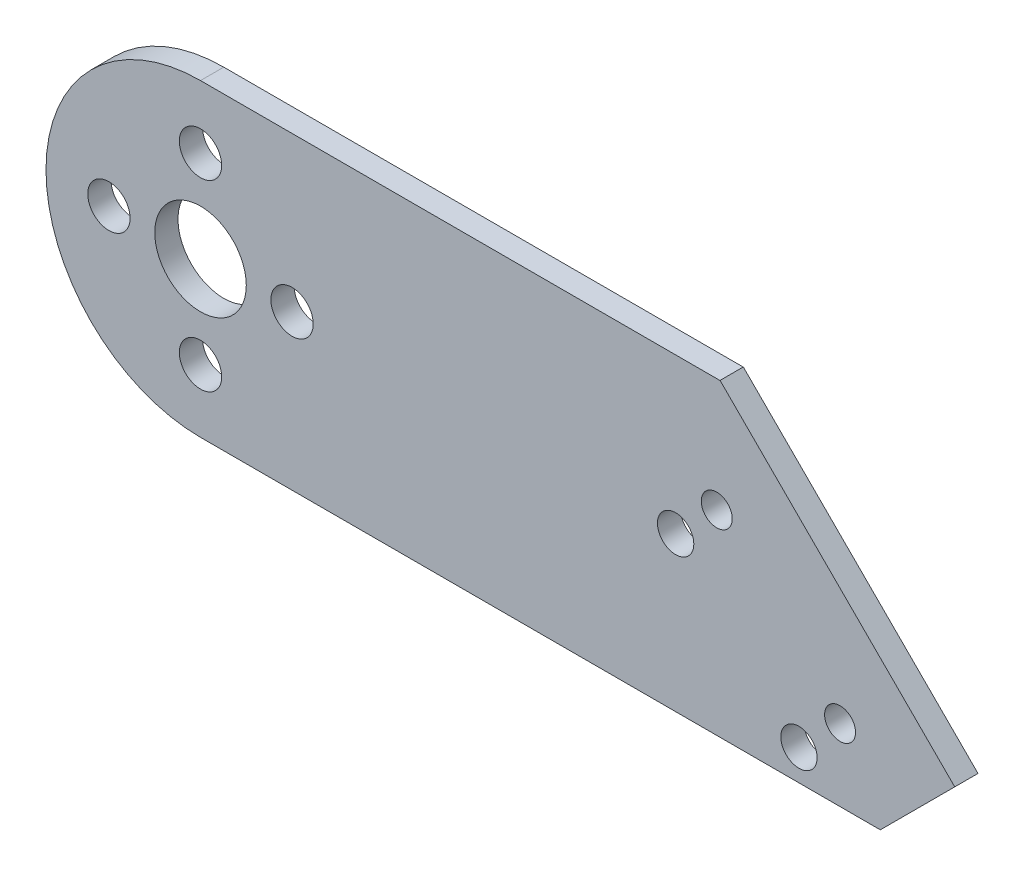
ISO-10303-21;
HEADER;
FILE_DESCRIPTION(('STEP AP214'),'2;1');
FILE_NAME('part.step','',(''),(''),'','','');
FILE_SCHEMA(('AUTOMOTIVE_DESIGN { 1 0 10303 214 1 1 1 1 }'));
ENDSEC;
DATA;
#1=APPLICATION_CONTEXT('core data for automotive mechanical design processes');
#2=APPLICATION_PROTOCOL_DEFINITION('international standard','automotive_design',2000,#1);
#3=PRODUCT_CONTEXT('',#1,'mechanical');
#4=PRODUCT('Part','Part','',(#3));
#5=PRODUCT_RELATED_PRODUCT_CATEGORY('part','',(#4));
#6=PRODUCT_DEFINITION_FORMATION('','',#4);
#7=PRODUCT_DEFINITION_CONTEXT('part definition',#1,'design');
#8=PRODUCT_DEFINITION('design','',#6,#7);
#9=PRODUCT_DEFINITION_SHAPE('','',#8);
#10=(LENGTH_UNIT() NAMED_UNIT(*) SI_UNIT(.MILLI.,.METRE.));
#11=(NAMED_UNIT(*) PLANE_ANGLE_UNIT() SI_UNIT($,.RADIAN.));
#12=(NAMED_UNIT(*) SI_UNIT($,.STERADIAN.) SOLID_ANGLE_UNIT());
#13=UNCERTAINTY_MEASURE_WITH_UNIT(LENGTH_MEASURE(1.E-05),#10,'distance_accuracy_value','');
#14=(GEOMETRIC_REPRESENTATION_CONTEXT(3) GLOBAL_UNCERTAINTY_ASSIGNED_CONTEXT((#13)) GLOBAL_UNIT_ASSIGNED_CONTEXT((#10,
#11,#12)) REPRESENTATION_CONTEXT('',''));
#15=CARTESIAN_POINT('',(0.,0.,0.));
#16=DIRECTION('',(0.,0.,1.));
#17=DIRECTION('',(1.,0.,0.));
#18=AXIS2_PLACEMENT_3D('',#15,#16,#17);
#19=CARTESIAN_POINT('',(0.,0.,2.032));
#20=DIRECTION('',(0.,0.,1.));
#21=DIRECTION('',(1.,0.,0.));
#22=AXIS2_PLACEMENT_3D('',#19,#20,#21);
#23=PLANE('',#22);
#24=CARTESIAN_POINT('',(41.5149259172451,-0.0303229251774669,2.032));
#25=DIRECTION('',(0.,0.,1.));
#26=DIRECTION('',(1.,0.,0.));
#27=AXIS2_PLACEMENT_3D('',#24,#25,#26);
#28=CIRCLE('',#27,1.5875);
#29=CARTESIAN_POINT('',(43.1024259172451,-0.0303229251774669,2.032));
#30=VERTEX_POINT('',#29);
#31=EDGE_CURVE('E221',#30,#30,#28,.T.);
#32=ORIENTED_EDGE('',*,*,#31,.F.);
#33=EDGE_LOOP('',(#32));
#34=FACE_BOUND('',#33,.T.);
#35=CARTESIAN_POINT('',(-7.99999999999998,0.,2.032));
#36=DIRECTION('',(0.,0.,1.));
#37=DIRECTION('',(1.,0.,0.));
#38=AXIS2_PLACEMENT_3D('',#35,#36,#37);
#39=CIRCLE('',#38,1.85);
#40=CARTESIAN_POINT('',(-6.14999999999998,0.,2.032));
#41=VERTEX_POINT('',#40);
#42=EDGE_CURVE('E233',#41,#41,#39,.T.);
#43=ORIENTED_EDGE('',*,*,#42,.F.);
#44=EDGE_LOOP('',(#43));
#45=FACE_BOUND('',#44,.T.);
#46=CARTESIAN_POINT('',(0.,0.,2.032));
#47=DIRECTION('',(0.,0.,1.));
#48=DIRECTION('',(1.,0.,0.));
#49=AXIS2_PLACEMENT_3D('',#46,#47,#48);
#50=CIRCLE('',#49,4.);
#51=CARTESIAN_POINT('',(4.00000000000003,0.,2.032));
#52=VERTEX_POINT('',#51);
#53=EDGE_CURVE('E245',#52,#52,#50,.T.);
#54=ORIENTED_EDGE('',*,*,#53,.F.);
#55=EDGE_LOOP('',(#54));
#56=FACE_BOUND('',#55,.T.);
#57=CARTESIAN_POINT('',(55.8833357109557,-7.2145278220328,2.032));
#58=DIRECTION('',(0.,0.,1.));
#59=DIRECTION('',(1.,0.,0.));
#60=AXIS2_PLACEMENT_3D('',#57,#58,#59);
#61=CIRCLE('',#60,1.35254999999999);
#62=CARTESIAN_POINT('',(57.2358857109557,-7.2145278220328,2.032));
#63=VERTEX_POINT('',#62);
#64=EDGE_CURVE('E257',#63,#63,#61,.T.);
#65=ORIENTED_EDGE('',*,*,#64,.F.);
#66=EDGE_LOOP('',(#65));
#67=FACE_BOUND('',#66,.T.);
#68=DIRECTION('',(-0.707106781186548,0.707106781186547,0.));
#69=VECTOR('',#68,1.);
#70=CARTESIAN_POINT('',(65.9023316935879,-6.99603182664613,2.032));
#71=LINE('',#70,#69);
#72=CARTESIAN_POINT('',(65.9023316935879,-6.99603182664613,2.032));
#73=VERTEX_POINT('',#72);
#74=CARTESIAN_POINT('',(45.396235039178,13.5100648277637,2.032));
#75=VERTEX_POINT('',#74);
#76=EDGE_CURVE('E141',#73,#75,#71,.T.);
#77=ORIENTED_EDGE('',*,*,#76,.T.);
#78=DIRECTION('',(-0.707106781187035,-0.70710678118606,0.));
#79=VECTOR('',#78,1.);
#80=CARTESIAN_POINT('',(45.396235039178,13.5100648277637,2.032));
#81=LINE('',#80,#79);
#82=CARTESIAN_POINT('',(45.3861702114143,13.5,2.032));
#83=VERTEX_POINT('',#82);
#84=EDGE_CURVE('E99',#75,#83,#81,.T.);
#85=ORIENTED_EDGE('',*,*,#84,.T.);
#86=DIRECTION('',(-1.,0.,0.));
#87=VECTOR('',#86,1.);
#88=CARTESIAN_POINT('',(45.3861702114143,13.5,2.032));
#89=LINE('',#88,#87);
#90=CARTESIAN_POINT('',(0.,13.5,2.032));
#91=VERTEX_POINT('',#90);
#92=EDGE_CURVE('E112',#83,#91,#89,.T.);
#93=ORIENTED_EDGE('',*,*,#92,.T.);
#94=CARTESIAN_POINT('',(0.,0.,2.032));
#95=DIRECTION('',(0.,0.,1.));
#96=DIRECTION('',(1.,0.,0.));
#97=AXIS2_PLACEMENT_3D('',#94,#95,#96);
#98=CIRCLE('',#97,13.5);
#99=CARTESIAN_POINT('',(0.,-13.5,2.032));
#100=VERTEX_POINT('',#99);
#101=EDGE_CURVE('E106',#91,#100,#98,.T.);
#102=ORIENTED_EDGE('',*,*,#101,.T.);
#103=DIRECTION('',(1.,0.,0.));
#104=VECTOR('',#103,1.);
#105=CARTESIAN_POINT('',(0.,-13.5,2.032));
#106=LINE('',#105,#104);
#107=CARTESIAN_POINT('',(59.398363520234,-13.5,2.032));
#108=VERTEX_POINT('',#107);
#109=EDGE_CURVE('E110',#100,#108,#106,.T.);
#110=ORIENTED_EDGE('',*,*,#109,.T.);
#111=DIRECTION('',(0.707106781186547,0.707106781186547,0.));
#112=VECTOR('',#111,1.);
#113=CARTESIAN_POINT('',(59.398363520234,-13.5,2.032));
#114=LINE('',#113,#112);
#115=EDGE_CURVE('E62',#108,#73,#114,.T.);
#116=ORIENTED_EDGE('',*,*,#115,.T.);
#117=EDGE_LOOP('',(#77,#85,#93,#102,#110,#116));
#118=FACE_BOUND('',#117,.T.);
#119=CARTESIAN_POINT('',(8.00000000000003,0.,2.032));
#120=DIRECTION('',(0.,0.,1.));
#121=DIRECTION('',(1.,0.,0.));
#122=AXIS2_PLACEMENT_3D('',#119,#120,#121);
#123=CIRCLE('',#122,1.85);
#124=CARTESIAN_POINT('',(9.85000000000003,0.,2.032));
#125=VERTEX_POINT('',#124);
#126=EDGE_CURVE('E134',#125,#125,#123,.T.);
#127=ORIENTED_EDGE('',*,*,#126,.F.);
#128=EDGE_LOOP('',(#127));
#129=FACE_BOUND('',#128,.T.);
#130=CARTESIAN_POINT('',(45.1070283656727,3.56177952325019,2.032));
#131=DIRECTION('',(0.,0.,1.));
#132=DIRECTION('',(1.,0.,0.));
#133=AXIS2_PLACEMENT_3D('',#130,#131,#132);
#134=CIRCLE('',#133,1.35254999999999);
#135=CARTESIAN_POINT('',(46.4595783656727,3.56177952325019,2.032));
#136=VERTEX_POINT('',#135);
#137=EDGE_CURVE('E251',#136,#136,#134,.T.);
#138=ORIENTED_EDGE('',*,*,#137,.F.);
#139=EDGE_LOOP('',(#138));
#140=FACE_BOUND('',#139,.T.);
#141=CARTESIAN_POINT('',(0.,-8.00000000000001,2.032));
#142=DIRECTION('',(0.,0.,1.));
#143=DIRECTION('',(1.,0.,0.));
#144=AXIS2_PLACEMENT_3D('',#141,#142,#143);
#145=CIRCLE('',#144,1.85);
#146=CARTESIAN_POINT('',(1.85000000000003,-8.00000000000001,2.032));
#147=VERTEX_POINT('',#146);
#148=EDGE_CURVE('E239',#147,#147,#145,.T.);
#149=ORIENTED_EDGE('',*,*,#148,.F.);
#150=EDGE_LOOP('',(#149));
#151=FACE_BOUND('',#150,.T.);
#152=CARTESIAN_POINT('',(0.,7.99999999999999,2.032));
#153=DIRECTION('',(0.,0.,1.));
#154=DIRECTION('',(1.,0.,0.));
#155=AXIS2_PLACEMENT_3D('',#152,#153,#154);
#156=CIRCLE('',#155,1.85);
#157=CARTESIAN_POINT('',(1.85000000000003,7.99999999999999,2.032));
#158=VERTEX_POINT('',#157);
#159=EDGE_CURVE('E227',#158,#158,#156,.T.);
#160=ORIENTED_EDGE('',*,*,#159,.F.);
#161=EDGE_LOOP('',(#160));
#162=FACE_BOUND('',#161,.T.);
#163=CARTESIAN_POINT('',(52.2912332625281,-10.8066302704605,2.032));
#164=DIRECTION('',(0.,0.,1.));
#165=DIRECTION('',(1.,0.,0.));
#166=AXIS2_PLACEMENT_3D('',#163,#164,#165);
#167=CIRCLE('',#166,1.5875);
#168=CARTESIAN_POINT('',(53.8787332625281,-10.8066302704605,2.032));
#169=VERTEX_POINT('',#168);
#170=EDGE_CURVE('E212',#169,#169,#167,.T.);
#171=ORIENTED_EDGE('',*,*,#170,.F.);
#172=EDGE_LOOP('',(#171));
#173=FACE_BOUND('',#172,.T.);
#174=ADVANCED_FACE('F45',(#34,#45,#56,#67,#118,#129,#140,#151,#162,#173),#23,.T.);
#175=CARTESIAN_POINT('',(0.,0.,0.));
#176=DIRECTION('',(0.,0.,1.));
#177=DIRECTION('',(1.,0.,0.));
#178=AXIS2_PLACEMENT_3D('',#175,#176,#177);
#179=PLANE('',#178);
#180=DIRECTION('',(-0.707106781186548,0.707106781186547,0.));
#181=VECTOR('',#180,1.);
#182=CARTESIAN_POINT('',(65.9023316935879,-6.99603182664613,0.));
#183=LINE('',#182,#181);
#184=CARTESIAN_POINT('',(65.9023316935879,-6.99603182664613,0.));
#185=VERTEX_POINT('',#184);
#186=CARTESIAN_POINT('',(45.396235039178,13.5100648277637,0.));
#187=VERTEX_POINT('',#186);
#188=EDGE_CURVE('E130',#185,#187,#183,.T.);
#189=ORIENTED_EDGE('',*,*,#188,.F.);
#190=DIRECTION('',(0.707106781186547,0.707106781186547,0.));
#191=VECTOR('',#190,1.);
#192=CARTESIAN_POINT('',(59.398363520234,-13.5,0.));
#193=LINE('',#192,#191);
#194=CARTESIAN_POINT('',(59.398363520234,-13.5,0.));
#195=VERTEX_POINT('',#194);
#196=EDGE_CURVE('E91',#195,#185,#193,.T.);
#197=ORIENTED_EDGE('',*,*,#196,.F.);
#198=DIRECTION('',(1.,0.,0.));
#199=VECTOR('',#198,1.);
#200=CARTESIAN_POINT('',(0.,-13.5,0.));
#201=LINE('',#200,#199);
#202=CARTESIAN_POINT('',(0.,-13.5,0.));
#203=VERTEX_POINT('',#202);
#204=EDGE_CURVE('E85',#203,#195,#201,.T.);
#205=ORIENTED_EDGE('',*,*,#204,.F.);
#206=CARTESIAN_POINT('',(0.,0.,0.));
#207=DIRECTION('',(0.,0.,1.));
#208=DIRECTION('',(1.,0.,0.));
#209=AXIS2_PLACEMENT_3D('',#206,#207,#208);
#210=CIRCLE('',#209,13.5);
#211=CARTESIAN_POINT('',(0.,13.5,0.));
#212=VERTEX_POINT('',#211);
#213=EDGE_CURVE('E120',#212,#203,#210,.T.);
#214=ORIENTED_EDGE('',*,*,#213,.F.);
#215=DIRECTION('',(-1.,0.,0.));
#216=VECTOR('',#215,1.);
#217=CARTESIAN_POINT('',(45.3861702114143,13.5,0.));
#218=LINE('',#217,#216);
#219=CARTESIAN_POINT('',(45.3861702114143,13.5,0.));
#220=VERTEX_POINT('',#219);
#221=EDGE_CURVE('E136',#220,#212,#218,.T.);
#222=ORIENTED_EDGE('',*,*,#221,.F.);
#223=DIRECTION('',(-0.707106781187035,-0.70710678118606,0.));
#224=VECTOR('',#223,1.);
#225=CARTESIAN_POINT('',(45.396235039178,13.5100648277637,0.));
#226=LINE('',#225,#224);
#227=EDGE_CURVE('E133',#187,#220,#226,.T.);
#228=ORIENTED_EDGE('',*,*,#227,.F.);
#229=EDGE_LOOP('',(#189,#197,#205,#214,#222,#228));
#230=FACE_BOUND('',#229,.T.);
#231=CARTESIAN_POINT('',(8.00000000000003,0.,0.));
#232=DIRECTION('',(0.,0.,1.));
#233=DIRECTION('',(1.,0.,0.));
#234=AXIS2_PLACEMENT_3D('',#231,#232,#233);
#235=CIRCLE('',#234,1.85);
#236=CARTESIAN_POINT('',(9.85000000000003,0.,0.));
#237=VERTEX_POINT('',#236);
#238=EDGE_CURVE('E260',#237,#237,#235,.T.);
#239=ORIENTED_EDGE('',*,*,#238,.T.);
#240=EDGE_LOOP('',(#239));
#241=FACE_BOUND('',#240,.T.);
#242=CARTESIAN_POINT('',(55.8833357109557,-7.2145278220328,0.));
#243=DIRECTION('',(0.,0.,1.));
#244=DIRECTION('',(1.,0.,0.));
#245=AXIS2_PLACEMENT_3D('',#242,#243,#244);
#246=CIRCLE('',#245,1.35254999999999);
#247=CARTESIAN_POINT('',(57.2358857109557,-7.2145278220328,0.));
#248=VERTEX_POINT('',#247);
#249=EDGE_CURVE('E254',#248,#248,#246,.T.);
#250=ORIENTED_EDGE('',*,*,#249,.T.);
#251=EDGE_LOOP('',(#250));
#252=FACE_BOUND('',#251,.T.);
#253=CARTESIAN_POINT('',(45.1070283656727,3.56177952325019,0.));
#254=DIRECTION('',(0.,0.,1.));
#255=DIRECTION('',(1.,0.,0.));
#256=AXIS2_PLACEMENT_3D('',#253,#254,#255);
#257=CIRCLE('',#256,1.35254999999999);
#258=CARTESIAN_POINT('',(46.4595783656727,3.56177952325019,0.));
#259=VERTEX_POINT('',#258);
#260=EDGE_CURVE('E248',#259,#259,#257,.T.);
#261=ORIENTED_EDGE('',*,*,#260,.T.);
#262=EDGE_LOOP('',(#261));
#263=FACE_BOUND('',#262,.T.);
#264=CARTESIAN_POINT('',(0.,0.,0.));
#265=DIRECTION('',(0.,0.,1.));
#266=DIRECTION('',(1.,0.,0.));
#267=AXIS2_PLACEMENT_3D('',#264,#265,#266);
#268=CIRCLE('',#267,4.);
#269=CARTESIAN_POINT('',(4.00000000000003,0.,0.));
#270=VERTEX_POINT('',#269);
#271=EDGE_CURVE('E242',#270,#270,#268,.T.);
#272=ORIENTED_EDGE('',*,*,#271,.T.);
#273=EDGE_LOOP('',(#272));
#274=FACE_BOUND('',#273,.T.);
#275=CARTESIAN_POINT('',(0.,-8.00000000000001,0.));
#276=DIRECTION('',(0.,0.,1.));
#277=DIRECTION('',(1.,0.,0.));
#278=AXIS2_PLACEMENT_3D('',#275,#276,#277);
#279=CIRCLE('',#278,1.85);
#280=CARTESIAN_POINT('',(1.85000000000003,-8.00000000000001,0.));
#281=VERTEX_POINT('',#280);
#282=EDGE_CURVE('E236',#281,#281,#279,.T.);
#283=ORIENTED_EDGE('',*,*,#282,.T.);
#284=EDGE_LOOP('',(#283));
#285=FACE_BOUND('',#284,.T.);
#286=CARTESIAN_POINT('',(-7.99999999999998,0.,0.));
#287=DIRECTION('',(0.,0.,1.));
#288=DIRECTION('',(1.,0.,0.));
#289=AXIS2_PLACEMENT_3D('',#286,#287,#288);
#290=CIRCLE('',#289,1.85);
#291=CARTESIAN_POINT('',(-6.14999999999998,0.,0.));
#292=VERTEX_POINT('',#291);
#293=EDGE_CURVE('E230',#292,#292,#290,.T.);
#294=ORIENTED_EDGE('',*,*,#293,.T.);
#295=EDGE_LOOP('',(#294));
#296=FACE_BOUND('',#295,.T.);
#297=CARTESIAN_POINT('',(0.,7.99999999999999,0.));
#298=DIRECTION('',(0.,0.,1.));
#299=DIRECTION('',(1.,0.,0.));
#300=AXIS2_PLACEMENT_3D('',#297,#298,#299);
#301=CIRCLE('',#300,1.85);
#302=CARTESIAN_POINT('',(1.85000000000003,7.99999999999999,0.));
#303=VERTEX_POINT('',#302);
#304=EDGE_CURVE('E224',#303,#303,#301,.T.);
#305=ORIENTED_EDGE('',*,*,#304,.T.);
#306=EDGE_LOOP('',(#305));
#307=FACE_BOUND('',#306,.T.);
#308=CARTESIAN_POINT('',(41.5149259172451,-0.0303229251774669,0.));
#309=DIRECTION('',(0.,0.,1.));
#310=DIRECTION('',(1.,0.,0.));
#311=AXIS2_PLACEMENT_3D('',#308,#309,#310);
#312=CIRCLE('',#311,1.5875);
#313=CARTESIAN_POINT('',(43.1024259172451,-0.0303229251774669,0.));
#314=VERTEX_POINT('',#313);
#315=EDGE_CURVE('E218',#314,#314,#312,.T.);
#316=ORIENTED_EDGE('',*,*,#315,.T.);
#317=EDGE_LOOP('',(#316));
#318=FACE_BOUND('',#317,.T.);
#319=CARTESIAN_POINT('',(52.2912332625281,-10.8066302704605,0.));
#320=DIRECTION('',(0.,0.,1.));
#321=DIRECTION('',(1.,0.,0.));
#322=AXIS2_PLACEMENT_3D('',#319,#320,#321);
#323=CIRCLE('',#322,1.5875);
#324=CARTESIAN_POINT('',(53.8787332625281,-10.8066302704605,0.));
#325=VERTEX_POINT('',#324);
#326=EDGE_CURVE('E215',#325,#325,#323,.T.);
#327=ORIENTED_EDGE('',*,*,#326,.T.);
#328=EDGE_LOOP('',(#327));
#329=FACE_BOUND('',#328,.T.);
#330=ADVANCED_FACE('F150',(#230,#241,#252,#263,#274,#285,#296,#307,#318,#329),#179,.F.);
#331=CARTESIAN_POINT('',(65.9023316935879,-6.99603182664613,2.032));
#332=DIRECTION('',(-0.707106781186547,-0.707106781186548,0.));
#333=DIRECTION('',(0.707106781186548,-0.707106781186547,0.));
#334=AXIS2_PLACEMENT_3D('',#331,#332,#333);
#335=PLANE('',#334);
#336=ORIENTED_EDGE('',*,*,#188,.T.);
#337=DIRECTION('',(0.,0.,-1.));
#338=VECTOR('',#337,1.);
#339=CARTESIAN_POINT('',(45.396235039178,13.5100648277637,2.032));
#340=LINE('',#339,#338);
#341=EDGE_CURVE('E13',#75,#187,#340,.T.);
#342=ORIENTED_EDGE('',*,*,#341,.F.);
#343=ORIENTED_EDGE('',*,*,#76,.F.);
#344=DIRECTION('',(0.,0.,-1.));
#345=VECTOR('',#344,1.);
#346=CARTESIAN_POINT('',(65.9023316935879,-6.99603182664613,2.032));
#347=LINE('',#346,#345);
#348=EDGE_CURVE('E126',#73,#185,#347,.T.);
#349=ORIENTED_EDGE('',*,*,#348,.T.);
#350=EDGE_LOOP('',(#336,#342,#343,#349));
#351=FACE_BOUND('',#350,.T.);
#352=ADVANCED_FACE('F47',(#351),#335,.F.);
#353=CARTESIAN_POINT('',(45.396235039178,13.5100648277637,2.032));
#354=DIRECTION('',(0.70710678118606,-0.707106781187035,0.));
#355=DIRECTION('',(0.707106781187035,0.70710678118606,0.));
#356=AXIS2_PLACEMENT_3D('',#353,#354,#355);
#357=PLANE('',#356);
#358=ORIENTED_EDGE('',*,*,#227,.T.);
#359=DIRECTION('',(0.,0.,-1.));
#360=VECTOR('',#359,1.);
#361=CARTESIAN_POINT('',(45.3861702114143,13.5,2.032));
#362=LINE('',#361,#360);
#363=EDGE_CURVE('E54',#83,#220,#362,.T.);
#364=ORIENTED_EDGE('',*,*,#363,.F.);
#365=ORIENTED_EDGE('',*,*,#84,.F.);
#366=ORIENTED_EDGE('',*,*,#341,.T.);
#367=EDGE_LOOP('',(#358,#364,#365,#366));
#368=FACE_BOUND('',#367,.T.);
#369=ADVANCED_FACE('F363',(#368),#357,.F.);
#370=CARTESIAN_POINT('',(45.3861702114143,13.5,2.032));
#371=DIRECTION('',(0.,-1.,0.));
#372=DIRECTION('',(1.,0.,0.));
#373=AXIS2_PLACEMENT_3D('',#370,#371,#372);
#374=PLANE('',#373);
#375=ORIENTED_EDGE('',*,*,#221,.T.);
#376=DIRECTION('',(0.,0.,-1.));
#377=VECTOR('',#376,1.);
#378=CARTESIAN_POINT('',(0.,13.5,2.032));
#379=LINE('',#378,#377);
#380=EDGE_CURVE('E121',#91,#212,#379,.T.);
#381=ORIENTED_EDGE('',*,*,#380,.F.);
#382=ORIENTED_EDGE('',*,*,#92,.F.);
#383=ORIENTED_EDGE('',*,*,#363,.T.);
#384=EDGE_LOOP('',(#375,#381,#382,#383));
#385=FACE_BOUND('',#384,.T.);
#386=ADVANCED_FACE('F147',(#385),#374,.F.);
#387=CARTESIAN_POINT('',(0.,0.,2.032));
#388=DIRECTION('',(0.,0.,-1.));
#389=DIRECTION('',(-1.,0.,0.));
#390=AXIS2_PLACEMENT_3D('',#387,#388,#389);
#391=CYLINDRICAL_SURFACE('',#390,13.5);
#392=ORIENTED_EDGE('',*,*,#213,.T.);
#393=DIRECTION('',(0.,0.,-1.));
#394=VECTOR('',#393,1.);
#395=CARTESIAN_POINT('',(0.,-13.5,2.032));
#396=LINE('',#395,#394);
#397=EDGE_CURVE('E117',#100,#203,#396,.T.);
#398=ORIENTED_EDGE('',*,*,#397,.F.);
#399=ORIENTED_EDGE('',*,*,#101,.F.);
#400=ORIENTED_EDGE('',*,*,#380,.T.);
#401=EDGE_LOOP('',(#392,#398,#399,#400));
#402=FACE_BOUND('',#401,.T.);
#403=ADVANCED_FACE('F118',(#402),#391,.T.);
#404=CARTESIAN_POINT('',(0.,-13.5,2.032));
#405=DIRECTION('',(0.,1.,0.));
#406=DIRECTION('',(-1.,0.,0.));
#407=AXIS2_PLACEMENT_3D('',#404,#405,#406);
#408=PLANE('',#407);
#409=ORIENTED_EDGE('',*,*,#204,.T.);
#410=DIRECTION('',(0.,0.,-1.));
#411=VECTOR('',#410,1.);
#412=CARTESIAN_POINT('',(59.398363520234,-13.5,2.032));
#413=LINE('',#412,#411);
#414=EDGE_CURVE('E122',#108,#195,#413,.T.);
#415=ORIENTED_EDGE('',*,*,#414,.F.);
#416=ORIENTED_EDGE('',*,*,#109,.F.);
#417=ORIENTED_EDGE('',*,*,#397,.T.);
#418=EDGE_LOOP('',(#409,#415,#416,#417));
#419=FACE_BOUND('',#418,.T.);
#420=ADVANCED_FACE('F124',(#419),#408,.F.);
#421=CARTESIAN_POINT('',(59.398363520234,-13.5,2.032));
#422=DIRECTION('',(-0.707106781186548,0.707106781186548,0.));
#423=DIRECTION('',(-0.707106781186548,-0.707106781186547,0.));
#424=AXIS2_PLACEMENT_3D('',#421,#422,#423);
#425=PLANE('',#424);
#426=ORIENTED_EDGE('',*,*,#196,.T.);
#427=ORIENTED_EDGE('',*,*,#348,.F.);
#428=ORIENTED_EDGE('',*,*,#115,.F.);
#429=ORIENTED_EDGE('',*,*,#414,.T.);
#430=EDGE_LOOP('',(#426,#427,#428,#429));
#431=FACE_BOUND('',#430,.T.);
#432=ADVANCED_FACE('F155',(#431),#425,.F.);
#433=CARTESIAN_POINT('',(8.00000000000003,0.,2.032));
#434=DIRECTION('',(0.,0.,-1.));
#435=DIRECTION('',(-1.,0.,0.));
#436=AXIS2_PLACEMENT_3D('',#433,#434,#435);
#437=CYLINDRICAL_SURFACE('',#436,1.85);
#438=ORIENTED_EDGE('',*,*,#126,.T.);
#439=EDGE_LOOP('',(#438));
#440=FACE_BOUND('',#439,.T.);
#441=ORIENTED_EDGE('',*,*,#238,.F.);
#442=EDGE_LOOP('',(#441));
#443=FACE_BOUND('',#442,.T.);
#444=ADVANCED_FACE('F157',(#440,#443),#437,.F.);
#445=CARTESIAN_POINT('',(55.8833357109557,-7.2145278220328,2.032));
#446=DIRECTION('',(0.,0.,-1.));
#447=DIRECTION('',(-1.,0.,0.));
#448=AXIS2_PLACEMENT_3D('',#445,#446,#447);
#449=CYLINDRICAL_SURFACE('',#448,1.35254999999999);
#450=ORIENTED_EDGE('',*,*,#64,.T.);
#451=EDGE_LOOP('',(#450));
#452=FACE_BOUND('',#451,.T.);
#453=ORIENTED_EDGE('',*,*,#249,.F.);
#454=EDGE_LOOP('',(#453));
#455=FACE_BOUND('',#454,.T.);
#456=ADVANCED_FACE('F163',(#452,#455),#449,.F.);
#457=CARTESIAN_POINT('',(45.1070283656727,3.56177952325019,2.032));
#458=DIRECTION('',(0.,0.,-1.));
#459=DIRECTION('',(-1.,0.,0.));
#460=AXIS2_PLACEMENT_3D('',#457,#458,#459);
#461=CYLINDRICAL_SURFACE('',#460,1.35254999999999);
#462=ORIENTED_EDGE('',*,*,#137,.T.);
#463=EDGE_LOOP('',(#462));
#464=FACE_BOUND('',#463,.T.);
#465=ORIENTED_EDGE('',*,*,#260,.F.);
#466=EDGE_LOOP('',(#465));
#467=FACE_BOUND('',#466,.T.);
#468=ADVANCED_FACE('F179',(#464,#467),#461,.F.);
#469=CARTESIAN_POINT('',(0.,0.,2.032));
#470=DIRECTION('',(0.,0.,-1.));
#471=DIRECTION('',(-1.,0.,0.));
#472=AXIS2_PLACEMENT_3D('',#469,#470,#471);
#473=CYLINDRICAL_SURFACE('',#472,4.);
#474=ORIENTED_EDGE('',*,*,#53,.T.);
#475=EDGE_LOOP('',(#474));
#476=FACE_BOUND('',#475,.T.);
#477=ORIENTED_EDGE('',*,*,#271,.F.);
#478=EDGE_LOOP('',(#477));
#479=FACE_BOUND('',#478,.T.);
#480=ADVANCED_FACE('F183',(#476,#479),#473,.F.);
#481=CARTESIAN_POINT('',(0.,-8.00000000000001,2.032));
#482=DIRECTION('',(0.,0.,-1.));
#483=DIRECTION('',(-1.,0.,0.));
#484=AXIS2_PLACEMENT_3D('',#481,#482,#483);
#485=CYLINDRICAL_SURFACE('',#484,1.85);
#486=ORIENTED_EDGE('',*,*,#148,.T.);
#487=EDGE_LOOP('',(#486));
#488=FACE_BOUND('',#487,.T.);
#489=ORIENTED_EDGE('',*,*,#282,.F.);
#490=EDGE_LOOP('',(#489));
#491=FACE_BOUND('',#490,.T.);
#492=ADVANCED_FACE('F187',(#488,#491),#485,.F.);
#493=CARTESIAN_POINT('',(-7.99999999999998,0.,2.032));
#494=DIRECTION('',(0.,0.,-1.));
#495=DIRECTION('',(-1.,0.,0.));
#496=AXIS2_PLACEMENT_3D('',#493,#494,#495);
#497=CYLINDRICAL_SURFACE('',#496,1.85);
#498=ORIENTED_EDGE('',*,*,#42,.T.);
#499=EDGE_LOOP('',(#498));
#500=FACE_BOUND('',#499,.T.);
#501=ORIENTED_EDGE('',*,*,#293,.F.);
#502=EDGE_LOOP('',(#501));
#503=FACE_BOUND('',#502,.T.);
#504=ADVANCED_FACE('F191',(#500,#503),#497,.F.);
#505=CARTESIAN_POINT('',(0.,7.99999999999999,2.032));
#506=DIRECTION('',(0.,0.,-1.));
#507=DIRECTION('',(-1.,0.,0.));
#508=AXIS2_PLACEMENT_3D('',#505,#506,#507);
#509=CYLINDRICAL_SURFACE('',#508,1.85);
#510=ORIENTED_EDGE('',*,*,#159,.T.);
#511=EDGE_LOOP('',(#510));
#512=FACE_BOUND('',#511,.T.);
#513=ORIENTED_EDGE('',*,*,#304,.F.);
#514=EDGE_LOOP('',(#513));
#515=FACE_BOUND('',#514,.T.);
#516=ADVANCED_FACE('F195',(#512,#515),#509,.F.);
#517=CARTESIAN_POINT('',(41.5149259172451,-0.0303229251774669,2.032));
#518=DIRECTION('',(0.,0.,-1.));
#519=DIRECTION('',(-1.,0.,0.));
#520=AXIS2_PLACEMENT_3D('',#517,#518,#519);
#521=CYLINDRICAL_SURFACE('',#520,1.5875);
#522=ORIENTED_EDGE('',*,*,#31,.T.);
#523=EDGE_LOOP('',(#522));
#524=FACE_BOUND('',#523,.T.);
#525=ORIENTED_EDGE('',*,*,#315,.F.);
#526=EDGE_LOOP('',(#525));
#527=FACE_BOUND('',#526,.T.);
#528=ADVANCED_FACE('F199',(#524,#527),#521,.F.);
#529=CARTESIAN_POINT('',(52.2912332625281,-10.8066302704605,2.032));
#530=DIRECTION('',(0.,0.,-1.));
#531=DIRECTION('',(-1.,0.,0.));
#532=AXIS2_PLACEMENT_3D('',#529,#530,#531);
#533=CYLINDRICAL_SURFACE('',#532,1.5875);
#534=ORIENTED_EDGE('',*,*,#170,.T.);
#535=EDGE_LOOP('',(#534));
#536=FACE_BOUND('',#535,.T.);
#537=ORIENTED_EDGE('',*,*,#326,.F.);
#538=EDGE_LOOP('',(#537));
#539=FACE_BOUND('',#538,.T.);
#540=ADVANCED_FACE('F203',(#536,#539),#533,.F.);
#541=CLOSED_SHELL('',(#174,#330,#352,#369,#386,#403,#420,#432,#444,#456,#468,#480,#492,#504,
#516,#528,#540));
#542=MANIFOLD_SOLID_BREP('B2',#541);
#543=ADVANCED_BREP_SHAPE_REPRESENTATION('',(#18,#542),#14);
#544=SHAPE_DEFINITION_REPRESENTATION(#9,#543);
ENDSEC;
END-ISO-10303-21;
